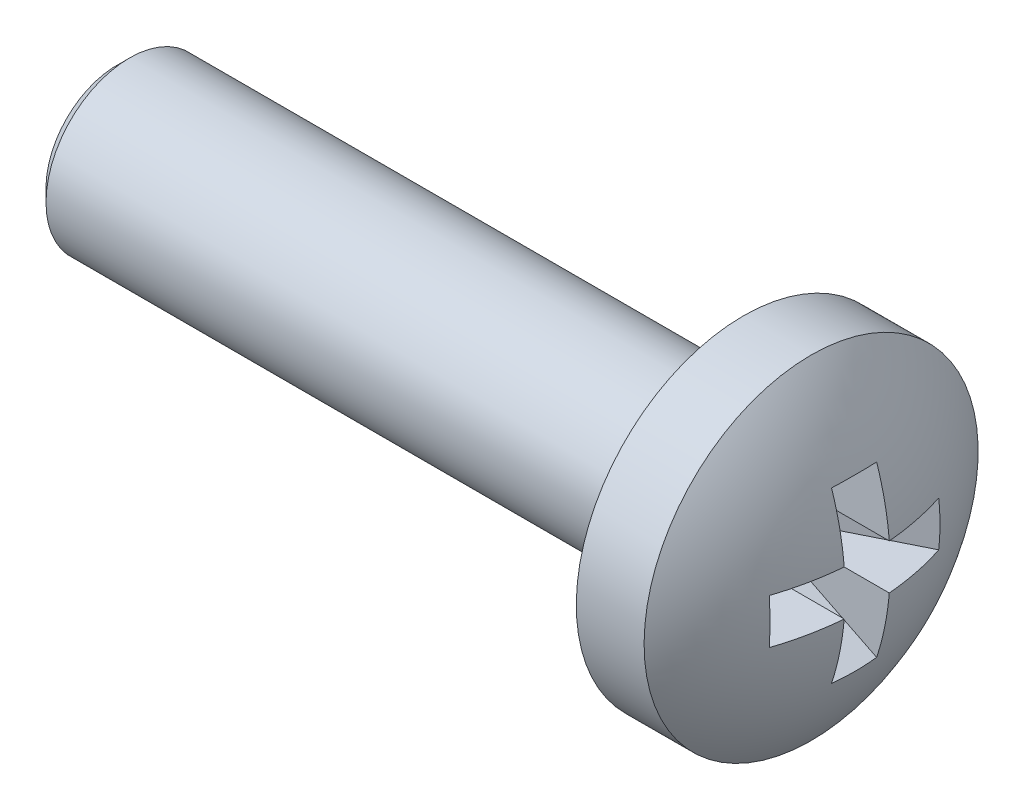
ISO-10303-21;
HEADER;
FILE_DESCRIPTION(('STEP AP214'),'2;1');
FILE_NAME('part.step','',(''),(''),'','','');
FILE_SCHEMA(('AUTOMOTIVE_DESIGN { 1 0 10303 214 1 1 1 1 }'));
ENDSEC;
DATA;
#1=APPLICATION_CONTEXT('core data for automotive mechanical design processes');
#2=APPLICATION_PROTOCOL_DEFINITION('international standard','automotive_design',2000,#1);
#3=PRODUCT_CONTEXT('',#1,'mechanical');
#4=PRODUCT('Part','Part','',(#3));
#5=PRODUCT_RELATED_PRODUCT_CATEGORY('part','',(#4));
#6=PRODUCT_DEFINITION_FORMATION('','',#4);
#7=PRODUCT_DEFINITION_CONTEXT('part definition',#1,'design');
#8=PRODUCT_DEFINITION('design','',#6,#7);
#9=PRODUCT_DEFINITION_SHAPE('','',#8);
#10=(LENGTH_UNIT() NAMED_UNIT(*) SI_UNIT(.MILLI.,.METRE.));
#11=(NAMED_UNIT(*) PLANE_ANGLE_UNIT() SI_UNIT($,.RADIAN.));
#12=(NAMED_UNIT(*) SI_UNIT($,.STERADIAN.) SOLID_ANGLE_UNIT());
#13=UNCERTAINTY_MEASURE_WITH_UNIT(LENGTH_MEASURE(1.E-05),#10,'distance_accuracy_value','');
#14=(GEOMETRIC_REPRESENTATION_CONTEXT(3) GLOBAL_UNCERTAINTY_ASSIGNED_CONTEXT((#13)) GLOBAL_UNIT_ASSIGNED_CONTEXT((#10,
#11,#12)) REPRESENTATION_CONTEXT('',''));
#15=CARTESIAN_POINT('',(0.,0.,0.));
#16=DIRECTION('',(0.,0.,1.));
#17=DIRECTION('',(1.,0.,0.));
#18=AXIS2_PLACEMENT_3D('',#15,#16,#17);
#19=CARTESIAN_POINT('',(-13.,0.,0.));
#20=DIRECTION('',(1.,0.,0.));
#21=DIRECTION('',(0.,-1.,0.));
#22=AXIS2_PLACEMENT_3D('',#19,#20,#21);
#23=SPHERICAL_SURFACE('',#22,13.);
#24=CARTESIAN_POINT('',(-12.1687957725923,0.,-1.66713776437291));
#25=DIRECTION('',(0.446197813109809,0.,-0.894934361602025));
#26=DIRECTION('',(-0.894934361602025,0.,-0.446197813109809));
#27=AXIS2_PLACEMENT_3D('',#24,#25,#26);
#28=CIRCLE('',#27,12.8658365918016);
#29=CARTESIAN_POINT('',(-0.695355024087683,1.08,4.05330877392233));
#30=VERTEX_POINT('',#29);
#31=CARTESIAN_POINT('',(-0.695355024087683,-1.08,4.05330877392233));
#32=VERTEX_POINT('',#31);
#33=EDGE_CURVE('E195',#30,#32,#28,.T.);
#34=ORIENTED_EDGE('',*,*,#33,.F.);
#35=CARTESIAN_POINT('',(-13.,1.08,0.));
#36=DIRECTION('',(0.,-1.,0.));
#37=DIRECTION('',(0.,0.,-1.));
#38=AXIS2_PLACEMENT_3D('',#35,#36,#37);
#39=CIRCLE('',#38,12.9550607871982);
#40=CARTESIAN_POINT('',(-0.0900348567472922,1.08,1.08));
#41=VERTEX_POINT('',#40);
#42=EDGE_CURVE('E114',#30,#41,#39,.F.);
#43=ORIENTED_EDGE('',*,*,#42,.T.);
#44=CARTESIAN_POINT('',(-13.,0.,1.08));
#45=DIRECTION('',(0.,0.,1.));
#46=DIRECTION('',(0.,-1.,0.));
#47=AXIS2_PLACEMENT_3D('',#44,#45,#46);
#48=CIRCLE('',#47,12.9550607871982);
#49=CARTESIAN_POINT('',(-0.695355024087685,4.05330877392233,1.08));
#50=VERTEX_POINT('',#49);
#51=EDGE_CURVE('E146',#50,#41,#48,.F.);
#52=ORIENTED_EDGE('',*,*,#51,.F.);
#53=CARTESIAN_POINT('',(-12.1687957725923,-1.66713776437291,0.));
#54=DIRECTION('',(0.446197813109809,-0.894934361602025,0.));
#55=DIRECTION('',(0.894934361602025,0.446197813109809,0.));
#56=AXIS2_PLACEMENT_3D('',#53,#54,#55);
#57=CIRCLE('',#56,12.8658365918016);
#58=CARTESIAN_POINT('',(-0.695355024087685,4.05330877392233,-1.08));
#59=VERTEX_POINT('',#58);
#60=EDGE_CURVE('E143',#50,#59,#57,.F.);
#61=ORIENTED_EDGE('',*,*,#60,.T.);
#62=CARTESIAN_POINT('',(-13.,0.,-1.08));
#63=DIRECTION('',(0.,0.,1.));
#64=DIRECTION('',(0.,-1.,0.));
#65=AXIS2_PLACEMENT_3D('',#62,#63,#64);
#66=CIRCLE('',#65,12.9550607871982);
#67=CARTESIAN_POINT('',(-0.0900348567472922,1.08,-1.08));
#68=VERTEX_POINT('',#67);
#69=EDGE_CURVE('E147',#59,#68,#66,.F.);
#70=ORIENTED_EDGE('',*,*,#69,.T.);
#71=CARTESIAN_POINT('',(-13.,1.08,0.));
#72=DIRECTION('',(0.,-1.,0.));
#73=DIRECTION('',(0.,0.,-1.));
#74=AXIS2_PLACEMENT_3D('',#71,#72,#73);
#75=CIRCLE('',#74,12.9550607871982);
#76=CARTESIAN_POINT('',(-0.695355024087685,1.08,-4.05330877392233));
#77=VERTEX_POINT('',#76);
#78=EDGE_CURVE('E197',#68,#77,#75,.F.);
#79=ORIENTED_EDGE('',*,*,#78,.T.);
#80=CARTESIAN_POINT('',(-12.1687957725923,0.,1.66713776437291));
#81=DIRECTION('',(0.446197813109809,0.,0.894934361602025));
#82=DIRECTION('',(0.894934361602025,0.,-0.446197813109809));
#83=AXIS2_PLACEMENT_3D('',#80,#81,#82);
#84=CIRCLE('',#83,12.8658365918016);
#85=CARTESIAN_POINT('',(-0.695355024087685,-1.08,-4.05330877392233));
#86=VERTEX_POINT('',#85);
#87=EDGE_CURVE('E200',#77,#86,#84,.F.);
#88=ORIENTED_EDGE('',*,*,#87,.T.);
#89=CARTESIAN_POINT('',(-13.,-1.08,0.));
#90=DIRECTION('',(0.,-1.,0.));
#91=DIRECTION('',(0.,0.,-1.));
#92=AXIS2_PLACEMENT_3D('',#89,#90,#91);
#93=CIRCLE('',#92,12.9550607871982);
#94=CARTESIAN_POINT('',(-0.0900348567472922,-1.08,-1.08));
#95=VERTEX_POINT('',#94);
#96=EDGE_CURVE('E201',#95,#86,#93,.F.);
#97=ORIENTED_EDGE('',*,*,#96,.F.);
#98=CARTESIAN_POINT('',(-13.,0.,-1.08));
#99=DIRECTION('',(0.,0.,1.));
#100=DIRECTION('',(0.,-1.,0.));
#101=AXIS2_PLACEMENT_3D('',#98,#99,#100);
#102=CIRCLE('',#101,12.9550607871982);
#103=CARTESIAN_POINT('',(-0.695355024087683,-4.05330877392233,-1.08));
#104=VERTEX_POINT('',#103);
#105=EDGE_CURVE('E157',#95,#104,#102,.F.);
#106=ORIENTED_EDGE('',*,*,#105,.T.);
#107=CARTESIAN_POINT('',(-12.1687957725923,1.66713776437291,0.));
#108=DIRECTION('',(0.446197813109809,0.894934361602025,0.));
#109=DIRECTION('',(-0.894934361602025,0.446197813109809,0.));
#110=AXIS2_PLACEMENT_3D('',#107,#108,#109);
#111=CIRCLE('',#110,12.8658365918016);
#112=CARTESIAN_POINT('',(-0.695355024087683,-4.05330877392233,1.08));
#113=VERTEX_POINT('',#112);
#114=EDGE_CURVE('E154',#113,#104,#111,.T.);
#115=ORIENTED_EDGE('',*,*,#114,.F.);
#116=CARTESIAN_POINT('',(-13.,0.,1.08));
#117=DIRECTION('',(0.,0.,1.));
#118=DIRECTION('',(0.,-1.,0.));
#119=AXIS2_PLACEMENT_3D('',#116,#117,#118);
#120=CIRCLE('',#119,12.9550607871982);
#121=CARTESIAN_POINT('',(-0.0900348567472922,-1.08,1.08));
#122=VERTEX_POINT('',#121);
#123=EDGE_CURVE('E158',#122,#113,#120,.F.);
#124=ORIENTED_EDGE('',*,*,#123,.F.);
#125=CARTESIAN_POINT('',(-13.,-1.08,0.));
#126=DIRECTION('',(0.,-1.,0.));
#127=DIRECTION('',(0.,0.,-1.));
#128=AXIS2_PLACEMENT_3D('',#125,#126,#127);
#129=CIRCLE('',#128,12.9550607871982);
#130=EDGE_CURVE('E193',#32,#122,#129,.F.);
#131=ORIENTED_EDGE('',*,*,#130,.F.);
#132=EDGE_LOOP('',(#34,#43,#52,#61,#70,#79,#88,#97,#106,#115,#124,#131));
#133=FACE_BOUND('',#132,.T.);
#134=CARTESIAN_POINT('',(-2.75304923404041,0.,0.));
#135=DIRECTION('',(1.,0.,0.));
#136=DIRECTION('',(0.,1.,0.));
#137=AXIS2_PLACEMENT_3D('',#134,#135,#136);
#138=CIRCLE('',#137,8.);
#139=CARTESIAN_POINT('',(-2.75304923404041,8.,0.));
#140=VERTEX_POINT('',#139);
#141=EDGE_CURVE('E118',#140,#140,#138,.T.);
#142=ORIENTED_EDGE('',*,*,#141,.T.);
#143=EDGE_LOOP('',(#142));
#144=FACE_BOUND('',#143,.T.);
#145=ADVANCED_FACE('F16',(#133,#144),#23,.T.);
#146=CARTESIAN_POINT('',(-36.,0.,0.));
#147=DIRECTION('',(-1.,0.,0.));
#148=DIRECTION('',(0.,-1.,0.));
#149=AXIS2_PLACEMENT_3D('',#146,#147,#148);
#150=PLANE('',#149);
#151=CARTESIAN_POINT('',(-36.,0.,0.));
#152=DIRECTION('',(-1.,0.,0.));
#153=DIRECTION('',(0.,-1.,0.));
#154=AXIS2_PLACEMENT_3D('',#151,#152,#153);
#155=CIRCLE('',#154,3.4);
#156=CARTESIAN_POINT('',(-36.,-3.4,0.));
#157=VERTEX_POINT('',#156);
#158=EDGE_CURVE('E10',#157,#157,#155,.T.);
#159=ORIENTED_EDGE('',*,*,#158,.T.);
#160=EDGE_LOOP('',(#159));
#161=FACE_BOUND('',#160,.T.);
#162=ADVANCED_FACE('F262',(#161),#150,.T.);
#163=CARTESIAN_POINT('',(0.,0.,0.));
#164=DIRECTION('',(1.,0.,0.));
#165=DIRECTION('',(0.,1.,0.));
#166=AXIS2_PLACEMENT_3D('',#163,#164,#165);
#167=CYLINDRICAL_SURFACE('',#166,4.);
#168=CARTESIAN_POINT('',(-35.4,0.,0.));
#169=DIRECTION('',(-1.,0.,0.));
#170=DIRECTION('',(0.,-1.,0.));
#171=AXIS2_PLACEMENT_3D('',#168,#169,#170);
#172=CIRCLE('',#171,4.);
#173=CARTESIAN_POINT('',(-35.4,-4.,0.));
#174=VERTEX_POINT('',#173);
#175=EDGE_CURVE('E26',#174,#174,#172,.F.);
#176=ORIENTED_EDGE('',*,*,#175,.T.);
#177=EDGE_LOOP('',(#176));
#178=FACE_BOUND('',#177,.T.);
#179=CARTESIAN_POINT('',(-6.,0.,0.));
#180=DIRECTION('',(1.,0.,0.));
#181=DIRECTION('',(0.,1.,0.));
#182=AXIS2_PLACEMENT_3D('',#179,#180,#181);
#183=CIRCLE('',#182,4.);
#184=CARTESIAN_POINT('',(-6.,4.,0.));
#185=VERTEX_POINT('',#184);
#186=EDGE_CURVE('E190',#185,#185,#183,.T.);
#187=ORIENTED_EDGE('',*,*,#186,.F.);
#188=EDGE_LOOP('',(#187));
#189=FACE_BOUND('',#188,.T.);
#190=ADVANCED_FACE('F268',(#178,#189),#167,.T.);
#191=CARTESIAN_POINT('',(-6.,4.,0.));
#192=DIRECTION('',(-1.,0.,0.));
#193=DIRECTION('',(0.,-1.,0.));
#194=AXIS2_PLACEMENT_3D('',#191,#192,#193);
#195=PLANE('',#194);
#196=ORIENTED_EDGE('',*,*,#186,.T.);
#197=EDGE_LOOP('',(#196));
#198=FACE_BOUND('',#197,.T.);
#199=CARTESIAN_POINT('',(-6.,0.,0.));
#200=DIRECTION('',(1.,0.,0.));
#201=DIRECTION('',(0.,1.,0.));
#202=AXIS2_PLACEMENT_3D('',#199,#200,#201);
#203=CIRCLE('',#202,8.);
#204=CARTESIAN_POINT('',(-6.,8.,0.));
#205=VERTEX_POINT('',#204);
#206=EDGE_CURVE('E187',#205,#205,#203,.T.);
#207=ORIENTED_EDGE('',*,*,#206,.F.);
#208=EDGE_LOOP('',(#207));
#209=FACE_BOUND('',#208,.T.);
#210=ADVANCED_FACE('F299',(#198,#209),#195,.T.);
#211=CARTESIAN_POINT('',(0.,0.,0.));
#212=DIRECTION('',(1.,0.,0.));
#213=DIRECTION('',(0.,1.,0.));
#214=AXIS2_PLACEMENT_3D('',#211,#212,#213);
#215=CYLINDRICAL_SURFACE('',#214,8.);
#216=ORIENTED_EDGE('',*,*,#206,.T.);
#217=EDGE_LOOP('',(#216));
#218=FACE_BOUND('',#217,.T.);
#219=ORIENTED_EDGE('',*,*,#141,.F.);
#220=EDGE_LOOP('',(#219));
#221=FACE_BOUND('',#220,.T.);
#222=ADVANCED_FACE('F296',(#218,#221),#215,.T.);
#223=CARTESIAN_POINT('',(0.,0.,4.4));
#224=DIRECTION('',(0.446197813109809,0.,-0.894934361602025));
#225=DIRECTION('',(-0.894934361602025,0.,-0.446197813109809));
#226=AXIS2_PLACEMENT_3D('',#223,#224,#225);
#227=PLANE('',#226);
#228=ORIENTED_EDGE('',*,*,#33,.T.);
#229=DIRECTION('',(-0.894934361602025,0.,-0.446197813109809));
#230=VECTOR('',#229,1.);
#231=CARTESIAN_POINT('',(0.,-1.08,4.4));
#232=LINE('',#231,#230);
#233=CARTESIAN_POINT('',(-4.5,-1.08,2.15638276375955));
#234=VERTEX_POINT('',#233);
#235=EDGE_CURVE('E35',#234,#32,#232,.F.);
#236=ORIENTED_EDGE('',*,*,#235,.F.);
#237=DIRECTION('',(0.,1.,0.));
#238=VECTOR('',#237,1.);
#239=CARTESIAN_POINT('',(-4.5,0.,2.15638276375955));
#240=LINE('',#239,#238);
#241=CARTESIAN_POINT('',(-4.5,1.08,2.15638276375955));
#242=VERTEX_POINT('',#241);
#243=EDGE_CURVE('E126',#242,#234,#240,.F.);
#244=ORIENTED_EDGE('',*,*,#243,.F.);
#245=DIRECTION('',(-0.894934361602025,0.,-0.446197813109809));
#246=VECTOR('',#245,1.);
#247=CARTESIAN_POINT('',(0.,1.08,4.4));
#248=LINE('',#247,#246);
#249=EDGE_CURVE('E107',#242,#30,#248,.F.);
#250=ORIENTED_EDGE('',*,*,#249,.T.);
#251=EDGE_LOOP('',(#228,#236,#244,#250));
#252=FACE_BOUND('',#251,.T.);
#253=ADVANCED_FACE('F18',(#252),#227,.T.);
#254=CARTESIAN_POINT('',(-4.5,1.08,0.));
#255=DIRECTION('',(0.,-1.,0.));
#256=DIRECTION('',(0.,0.,-1.));
#257=AXIS2_PLACEMENT_3D('',#254,#255,#256);
#258=PLANE('',#257);
#259=ORIENTED_EDGE('',*,*,#249,.F.);
#260=DIRECTION('',(0.,0.,-1.));
#261=VECTOR('',#260,1.);
#262=CARTESIAN_POINT('',(-4.5,1.08,0.));
#263=LINE('',#262,#261);
#264=CARTESIAN_POINT('',(-4.5,1.08,1.08));
#265=VERTEX_POINT('',#264);
#266=EDGE_CURVE('E111',#242,#265,#263,.T.);
#267=ORIENTED_EDGE('',*,*,#266,.T.);
#268=DIRECTION('',(1.,0.,0.));
#269=VECTOR('',#268,1.);
#270=CARTESIAN_POINT('',(-4.5,1.08,1.08));
#271=LINE('',#270,#269);
#272=EDGE_CURVE('E119',#265,#41,#271,.T.);
#273=ORIENTED_EDGE('',*,*,#272,.T.);
#274=ORIENTED_EDGE('',*,*,#42,.F.);
#275=EDGE_LOOP('',(#259,#267,#273,#274));
#276=FACE_BOUND('',#275,.T.);
#277=ADVANCED_FACE('F109',(#276),#258,.T.);
#278=CARTESIAN_POINT('',(-4.5,0.,1.08));
#279=DIRECTION('',(0.,0.,1.));
#280=DIRECTION('',(0.,-1.,0.));
#281=AXIS2_PLACEMENT_3D('',#278,#279,#280);
#282=PLANE('',#281);
#283=ORIENTED_EDGE('',*,*,#51,.T.);
#284=ORIENTED_EDGE('',*,*,#272,.F.);
#285=DIRECTION('',(0.,-1.,0.));
#286=VECTOR('',#285,1.);
#287=CARTESIAN_POINT('',(-4.5,0.,1.08));
#288=LINE('',#287,#286);
#289=CARTESIAN_POINT('',(-4.5,2.15638276375956,1.08));
#290=VERTEX_POINT('',#289);
#291=EDGE_CURVE('E129',#290,#265,#288,.T.);
#292=ORIENTED_EDGE('',*,*,#291,.F.);
#293=DIRECTION('',(0.894934361602025,0.446197813109809,0.));
#294=VECTOR('',#293,1.);
#295=CARTESIAN_POINT('',(-5.36108192419615,1.72706315332809,1.08));
#296=LINE('',#295,#294);
#297=EDGE_CURVE('E139',#290,#50,#296,.T.);
#298=ORIENTED_EDGE('',*,*,#297,.T.);
#299=EDGE_LOOP('',(#283,#284,#292,#298));
#300=FACE_BOUND('',#299,.T.);
#301=ADVANCED_FACE('F250',(#300),#282,.F.);
#302=CARTESIAN_POINT('',(0.,4.4,0.));
#303=DIRECTION('',(0.446197813109809,-0.894934361602025,0.));
#304=DIRECTION('',(0.894934361602025,0.446197813109809,0.));
#305=AXIS2_PLACEMENT_3D('',#302,#303,#304);
#306=PLANE('',#305);
#307=ORIENTED_EDGE('',*,*,#297,.F.);
#308=DIRECTION('',(0.,0.,-1.));
#309=VECTOR('',#308,1.);
#310=CARTESIAN_POINT('',(-4.5,2.15638276375956,0.));
#311=LINE('',#310,#309);
#312=CARTESIAN_POINT('',(-4.5,2.15638276375956,-1.08));
#313=VERTEX_POINT('',#312);
#314=EDGE_CURVE('E151',#290,#313,#311,.T.);
#315=ORIENTED_EDGE('',*,*,#314,.T.);
#316=DIRECTION('',(0.894934361602025,0.446197813109809,0.));
#317=VECTOR('',#316,1.);
#318=CARTESIAN_POINT('',(-5.36108192419615,1.72706315332809,-1.08));
#319=LINE('',#318,#317);
#320=EDGE_CURVE('E142',#313,#59,#319,.T.);
#321=ORIENTED_EDGE('',*,*,#320,.T.);
#322=ORIENTED_EDGE('',*,*,#60,.F.);
#323=EDGE_LOOP('',(#307,#315,#321,#322));
#324=FACE_BOUND('',#323,.T.);
#325=ADVANCED_FACE('F248',(#324),#306,.T.);
#326=CARTESIAN_POINT('',(-4.5,0.,-1.08));
#327=DIRECTION('',(0.,0.,1.));
#328=DIRECTION('',(0.,-1.,0.));
#329=AXIS2_PLACEMENT_3D('',#326,#327,#328);
#330=PLANE('',#329);
#331=ORIENTED_EDGE('',*,*,#320,.F.);
#332=DIRECTION('',(0.,-1.,0.));
#333=VECTOR('',#332,1.);
#334=CARTESIAN_POINT('',(-4.5,0.,-1.08));
#335=LINE('',#334,#333);
#336=CARTESIAN_POINT('',(-4.5,1.08,-1.08));
#337=VERTEX_POINT('',#336);
#338=EDGE_CURVE('E153',#313,#337,#335,.T.);
#339=ORIENTED_EDGE('',*,*,#338,.T.);
#340=DIRECTION('',(1.,0.,0.));
#341=VECTOR('',#340,1.);
#342=CARTESIAN_POINT('',(-4.5,1.08,-1.08));
#343=LINE('',#342,#341);
#344=EDGE_CURVE('E150',#337,#68,#343,.T.);
#345=ORIENTED_EDGE('',*,*,#344,.T.);
#346=ORIENTED_EDGE('',*,*,#69,.F.);
#347=EDGE_LOOP('',(#331,#339,#345,#346));
#348=FACE_BOUND('',#347,.T.);
#349=ADVANCED_FACE('F245',(#348),#330,.T.);
#350=CARTESIAN_POINT('',(-4.5,1.08,0.));
#351=DIRECTION('',(0.,-1.,0.));
#352=DIRECTION('',(0.,0.,-1.));
#353=AXIS2_PLACEMENT_3D('',#350,#351,#352);
#354=PLANE('',#353);
#355=ORIENTED_EDGE('',*,*,#344,.F.);
#356=DIRECTION('',(0.,0.,-1.));
#357=VECTOR('',#356,1.);
#358=CARTESIAN_POINT('',(-4.5,1.08,0.));
#359=LINE('',#358,#357);
#360=CARTESIAN_POINT('',(-4.5,1.08,-2.15638276375956));
#361=VERTEX_POINT('',#360);
#362=EDGE_CURVE('E173',#337,#361,#359,.T.);
#363=ORIENTED_EDGE('',*,*,#362,.T.);
#364=DIRECTION('',(0.894934361602025,0.,-0.446197813109809));
#365=VECTOR('',#364,1.);
#366=CARTESIAN_POINT('',(0.,1.08,-4.4));
#367=LINE('',#366,#365);
#368=EDGE_CURVE('E180',#361,#77,#367,.T.);
#369=ORIENTED_EDGE('',*,*,#368,.T.);
#370=ORIENTED_EDGE('',*,*,#78,.F.);
#371=EDGE_LOOP('',(#355,#363,#369,#370));
#372=FACE_BOUND('',#371,.T.);
#373=ADVANCED_FACE('F242',(#372),#354,.T.);
#374=CARTESIAN_POINT('',(0.,0.,-4.4));
#375=DIRECTION('',(0.446197813109809,0.,0.894934361602025));
#376=DIRECTION('',(0.894934361602025,0.,-0.446197813109809));
#377=AXIS2_PLACEMENT_3D('',#374,#375,#376);
#378=PLANE('',#377);
#379=ORIENTED_EDGE('',*,*,#368,.F.);
#380=DIRECTION('',(0.,-1.,0.));
#381=VECTOR('',#380,1.);
#382=CARTESIAN_POINT('',(-4.5,0.,-2.15638276375956));
#383=LINE('',#382,#381);
#384=CARTESIAN_POINT('',(-4.5,-1.08,-2.15638276375956));
#385=VERTEX_POINT('',#384);
#386=EDGE_CURVE('E172',#361,#385,#383,.T.);
#387=ORIENTED_EDGE('',*,*,#386,.T.);
#388=DIRECTION('',(0.894934361602025,0.,-0.446197813109809));
#389=VECTOR('',#388,1.);
#390=CARTESIAN_POINT('',(0.,-1.08,-4.4));
#391=LINE('',#390,#389);
#392=EDGE_CURVE('E182',#385,#86,#391,.T.);
#393=ORIENTED_EDGE('',*,*,#392,.T.);
#394=ORIENTED_EDGE('',*,*,#87,.F.);
#395=EDGE_LOOP('',(#379,#387,#393,#394));
#396=FACE_BOUND('',#395,.T.);
#397=ADVANCED_FACE('F236',(#396),#378,.T.);
#398=CARTESIAN_POINT('',(-4.5,-1.08,0.));
#399=DIRECTION('',(0.,-1.,0.));
#400=DIRECTION('',(0.,0.,-1.));
#401=AXIS2_PLACEMENT_3D('',#398,#399,#400);
#402=PLANE('',#401);
#403=ORIENTED_EDGE('',*,*,#96,.T.);
#404=ORIENTED_EDGE('',*,*,#392,.F.);
#405=DIRECTION('',(0.,0.,-1.));
#406=VECTOR('',#405,1.);
#407=CARTESIAN_POINT('',(-4.5,-1.08,0.));
#408=LINE('',#407,#406);
#409=CARTESIAN_POINT('',(-4.5,-1.08,-1.08));
#410=VERTEX_POINT('',#409);
#411=EDGE_CURVE('E165',#410,#385,#408,.T.);
#412=ORIENTED_EDGE('',*,*,#411,.F.);
#413=DIRECTION('',(1.,0.,0.));
#414=VECTOR('',#413,1.);
#415=CARTESIAN_POINT('',(-4.5,-1.08,-1.08));
#416=LINE('',#415,#414);
#417=EDGE_CURVE('E79',#410,#95,#416,.T.);
#418=ORIENTED_EDGE('',*,*,#417,.T.);
#419=EDGE_LOOP('',(#403,#404,#412,#418));
#420=FACE_BOUND('',#419,.T.);
#421=ADVANCED_FACE('F232',(#420),#402,.F.);
#422=CARTESIAN_POINT('',(-4.5,0.,-1.08));
#423=DIRECTION('',(0.,0.,1.));
#424=DIRECTION('',(0.,-1.,0.));
#425=AXIS2_PLACEMENT_3D('',#422,#423,#424);
#426=PLANE('',#425);
#427=ORIENTED_EDGE('',*,*,#417,.F.);
#428=DIRECTION('',(0.,-1.,0.));
#429=VECTOR('',#428,1.);
#430=CARTESIAN_POINT('',(-4.5,0.,-1.08));
#431=LINE('',#430,#429);
#432=CARTESIAN_POINT('',(-4.5,-2.15638276375955,-1.08));
#433=VERTEX_POINT('',#432);
#434=EDGE_CURVE('E73',#410,#433,#431,.T.);
#435=ORIENTED_EDGE('',*,*,#434,.T.);
#436=DIRECTION('',(-0.894934361602025,0.446197813109809,0.));
#437=VECTOR('',#436,1.);
#438=CARTESIAN_POINT('',(-5.36108192419615,-1.72706315332809,-1.08));
#439=LINE('',#438,#437);
#440=EDGE_CURVE('E20',#433,#104,#439,.F.);
#441=ORIENTED_EDGE('',*,*,#440,.T.);
#442=ORIENTED_EDGE('',*,*,#105,.F.);
#443=EDGE_LOOP('',(#427,#435,#441,#442));
#444=FACE_BOUND('',#443,.T.);
#445=ADVANCED_FACE('F228',(#444),#426,.T.);
#446=CARTESIAN_POINT('',(0.,-4.4,0.));
#447=DIRECTION('',(0.446197813109809,0.894934361602025,0.));
#448=DIRECTION('',(-0.894934361602025,0.446197813109809,0.));
#449=AXIS2_PLACEMENT_3D('',#446,#447,#448);
#450=PLANE('',#449);
#451=ORIENTED_EDGE('',*,*,#114,.T.);
#452=ORIENTED_EDGE('',*,*,#440,.F.);
#453=DIRECTION('',(0.,0.,1.));
#454=VECTOR('',#453,1.);
#455=CARTESIAN_POINT('',(-4.5,-2.15638276375955,0.));
#456=LINE('',#455,#454);
#457=CARTESIAN_POINT('',(-4.5,-2.15638276375955,1.08));
#458=VERTEX_POINT('',#457);
#459=EDGE_CURVE('E161',#458,#433,#456,.F.);
#460=ORIENTED_EDGE('',*,*,#459,.F.);
#461=DIRECTION('',(-0.894934361602025,0.446197813109809,0.));
#462=VECTOR('',#461,1.);
#463=CARTESIAN_POINT('',(-5.36108192419615,-1.72706315332809,1.08));
#464=LINE('',#463,#462);
#465=EDGE_CURVE('E159',#458,#113,#464,.F.);
#466=ORIENTED_EDGE('',*,*,#465,.T.);
#467=EDGE_LOOP('',(#451,#452,#460,#466));
#468=FACE_BOUND('',#467,.T.);
#469=ADVANCED_FACE('F227',(#468),#450,.T.);
#470=CARTESIAN_POINT('',(-4.5,0.,1.08));
#471=DIRECTION('',(0.,0.,1.));
#472=DIRECTION('',(0.,-1.,0.));
#473=AXIS2_PLACEMENT_3D('',#470,#471,#472);
#474=PLANE('',#473);
#475=ORIENTED_EDGE('',*,*,#123,.T.);
#476=ORIENTED_EDGE('',*,*,#465,.F.);
#477=DIRECTION('',(0.,-1.,0.));
#478=VECTOR('',#477,1.);
#479=CARTESIAN_POINT('',(-4.5,0.,1.08));
#480=LINE('',#479,#478);
#481=CARTESIAN_POINT('',(-4.5,-1.08,1.08));
#482=VERTEX_POINT('',#481);
#483=EDGE_CURVE('E133',#482,#458,#480,.T.);
#484=ORIENTED_EDGE('',*,*,#483,.F.);
#485=DIRECTION('',(1.,0.,0.));
#486=VECTOR('',#485,1.);
#487=CARTESIAN_POINT('',(-4.5,-1.08,1.08));
#488=LINE('',#487,#486);
#489=EDGE_CURVE('E138',#482,#122,#488,.T.);
#490=ORIENTED_EDGE('',*,*,#489,.T.);
#491=EDGE_LOOP('',(#475,#476,#484,#490));
#492=FACE_BOUND('',#491,.T.);
#493=ADVANCED_FACE('F225',(#492),#474,.F.);
#494=CARTESIAN_POINT('',(-4.5,-1.08,0.));
#495=DIRECTION('',(0.,-1.,0.));
#496=DIRECTION('',(0.,0.,-1.));
#497=AXIS2_PLACEMENT_3D('',#494,#495,#496);
#498=PLANE('',#497);
#499=ORIENTED_EDGE('',*,*,#130,.T.);
#500=ORIENTED_EDGE('',*,*,#489,.F.);
#501=DIRECTION('',(0.,0.,-1.));
#502=VECTOR('',#501,1.);
#503=CARTESIAN_POINT('',(-4.5,-1.08,0.));
#504=LINE('',#503,#502);
#505=EDGE_CURVE('E131',#234,#482,#504,.T.);
#506=ORIENTED_EDGE('',*,*,#505,.F.);
#507=ORIENTED_EDGE('',*,*,#235,.T.);
#508=EDGE_LOOP('',(#499,#500,#506,#507));
#509=FACE_BOUND('',#508,.T.);
#510=ADVANCED_FACE('F223',(#509),#498,.F.);
#511=CARTESIAN_POINT('',(-4.5,0.,0.));
#512=DIRECTION('',(1.,0.,0.));
#513=DIRECTION('',(0.,0.,-1.));
#514=AXIS2_PLACEMENT_3D('',#511,#512,#513);
#515=PLANE('',#514);
#516=ORIENTED_EDGE('',*,*,#243,.T.);
#517=ORIENTED_EDGE('',*,*,#505,.T.);
#518=ORIENTED_EDGE('',*,*,#483,.T.);
#519=ORIENTED_EDGE('',*,*,#459,.T.);
#520=ORIENTED_EDGE('',*,*,#434,.F.);
#521=ORIENTED_EDGE('',*,*,#411,.T.);
#522=ORIENTED_EDGE('',*,*,#386,.F.);
#523=ORIENTED_EDGE('',*,*,#362,.F.);
#524=ORIENTED_EDGE('',*,*,#338,.F.);
#525=ORIENTED_EDGE('',*,*,#314,.F.);
#526=ORIENTED_EDGE('',*,*,#291,.T.);
#527=ORIENTED_EDGE('',*,*,#266,.F.);
#528=EDGE_LOOP('',(#516,#517,#518,#519,#520,#521,#522,#523,#524,#525,#526,#527));
#529=FACE_BOUND('',#528,.T.);
#530=ADVANCED_FACE('F124',(#529),#515,.T.);
#531=CARTESIAN_POINT('',(-35.4,0.,0.));
#532=DIRECTION('',(1.,0.,0.));
#533=DIRECTION('',(0.,1.,0.));
#534=AXIS2_PLACEMENT_3D('',#531,#532,#533);
#535=CONICAL_SURFACE('',#534,4.,0.785398163397442);
#536=ORIENTED_EDGE('',*,*,#158,.F.);
#537=EDGE_LOOP('',(#536));
#538=FACE_BOUND('',#537,.T.);
#539=ORIENTED_EDGE('',*,*,#175,.F.);
#540=EDGE_LOOP('',(#539));
#541=FACE_BOUND('',#540,.T.);
#542=ADVANCED_FACE('F273',(#538,#541),#535,.T.);
#543=CLOSED_SHELL('',(#145,#162,#190,#210,#222,#253,#277,#301,#325,#349,#373,#397,#421,#445,
#469,#493,#510,#530,#542));
#544=MANIFOLD_SOLID_BREP('B1',#543);
#545=ADVANCED_BREP_SHAPE_REPRESENTATION('',(#18,#544),#14);
#546=SHAPE_DEFINITION_REPRESENTATION(#9,#545);
ENDSEC;
END-ISO-10303-21;
